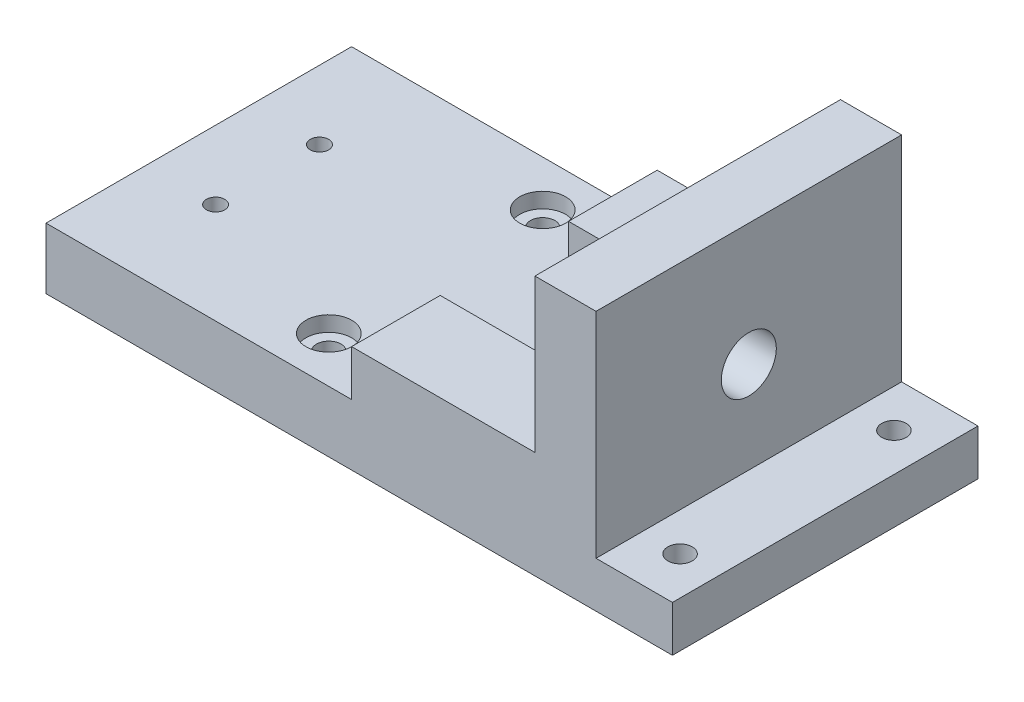
ISO-10303-21;
HEADER;
FILE_DESCRIPTION(('STEP AP214'),'2;1');
FILE_NAME('part.step','',(''),(''),'','','');
FILE_SCHEMA(('AUTOMOTIVE_DESIGN { 1 0 10303 214 1 1 1 1 }'));
ENDSEC;
DATA;
#1=APPLICATION_CONTEXT('core data for automotive mechanical design processes');
#2=APPLICATION_PROTOCOL_DEFINITION('international standard','automotive_design',2000,#1);
#3=PRODUCT_CONTEXT('',#1,'mechanical');
#4=PRODUCT('Part','Part','',(#3));
#5=PRODUCT_RELATED_PRODUCT_CATEGORY('part','',(#4));
#6=PRODUCT_DEFINITION_FORMATION('','',#4);
#7=PRODUCT_DEFINITION_CONTEXT('part definition',#1,'design');
#8=PRODUCT_DEFINITION('design','',#6,#7);
#9=PRODUCT_DEFINITION_SHAPE('','',#8);
#10=(LENGTH_UNIT() NAMED_UNIT(*) SI_UNIT(.MILLI.,.METRE.));
#11=(NAMED_UNIT(*) PLANE_ANGLE_UNIT() SI_UNIT($,.RADIAN.));
#12=(NAMED_UNIT(*) SI_UNIT($,.STERADIAN.) SOLID_ANGLE_UNIT());
#13=UNCERTAINTY_MEASURE_WITH_UNIT(LENGTH_MEASURE(1.E-05),#10,'distance_accuracy_value','');
#14=(GEOMETRIC_REPRESENTATION_CONTEXT(3) GLOBAL_UNCERTAINTY_ASSIGNED_CONTEXT((#13)) GLOBAL_UNIT_ASSIGNED_CONTEXT((#10,
#11,#12)) REPRESENTATION_CONTEXT('',''));
#15=CARTESIAN_POINT('',(0.,0.,0.));
#16=DIRECTION('',(0.,0.,1.));
#17=DIRECTION('',(1.,0.,0.));
#18=AXIS2_PLACEMENT_3D('',#15,#16,#17);
#19=CARTESIAN_POINT('',(-229.725095615959,-32.3557386046512,85.));
#20=DIRECTION('',(0.,1.,0.));
#21=DIRECTION('',(-1.,0.,0.));
#22=AXIS2_PLACEMENT_3D('',#19,#20,#21);
#23=CYLINDRICAL_SURFACE('',#22,3.99999999999999);
#24=CARTESIAN_POINT('',(-229.725095615959,-26.3557386046512,85.));
#25=DIRECTION('',(0.,1.,0.));
#26=DIRECTION('',(-1.,0.,0.));
#27=AXIS2_PLACEMENT_3D('',#24,#25,#26);
#28=CIRCLE('',#27,3.99999999999999);
#29=CARTESIAN_POINT('',(-233.725095615959,-26.3557386046512,85.));
#30=VERTEX_POINT('',#29);
#31=EDGE_CURVE('E231',#30,#30,#28,.F.);
#32=ORIENTED_EDGE('',*,*,#31,.T.);
#33=EDGE_LOOP('',(#32));
#34=FACE_BOUND('',#33,.T.);
#35=CARTESIAN_POINT('',(-229.725095615959,-11.3557386046512,85.));
#36=DIRECTION('',(0.,1.,0.));
#37=DIRECTION('',(-1.,0.,0.));
#38=AXIS2_PLACEMENT_3D('',#35,#36,#37);
#39=CIRCLE('',#38,3.99999999999999);
#40=CARTESIAN_POINT('',(-233.725095615959,-11.3557386046512,85.));
#41=VERTEX_POINT('',#40);
#42=EDGE_CURVE('E39',#41,#41,#39,.T.);
#43=ORIENTED_EDGE('',*,*,#42,.T.);
#44=EDGE_LOOP('',(#43));
#45=FACE_BOUND('',#44,.T.);
#46=ADVANCED_FACE('F35',(#34,#45),#23,.F.);
#47=CARTESIAN_POINT('',(-229.725095615959,-32.3557386046512,15.));
#48=DIRECTION('',(0.,1.,0.));
#49=DIRECTION('',(-1.,0.,0.));
#50=AXIS2_PLACEMENT_3D('',#47,#48,#49);
#51=CYLINDRICAL_SURFACE('',#50,3.99999999999999);
#52=CARTESIAN_POINT('',(-229.725095615959,-26.3557386046512,15.));
#53=DIRECTION('',(0.,1.,0.));
#54=DIRECTION('',(-1.,0.,0.));
#55=AXIS2_PLACEMENT_3D('',#52,#53,#54);
#56=CIRCLE('',#55,3.99999999999999);
#57=CARTESIAN_POINT('',(-233.725095615959,-26.3557386046512,15.));
#58=VERTEX_POINT('',#57);
#59=EDGE_CURVE('E219',#58,#58,#56,.T.);
#60=ORIENTED_EDGE('',*,*,#59,.F.);
#61=EDGE_LOOP('',(#60));
#62=FACE_BOUND('',#61,.T.);
#63=CARTESIAN_POINT('',(-229.725095615959,-11.3557386046512,15.));
#64=DIRECTION('',(0.,1.,0.));
#65=DIRECTION('',(-1.,0.,0.));
#66=AXIS2_PLACEMENT_3D('',#63,#64,#65);
#67=CIRCLE('',#66,3.99999999999999);
#68=CARTESIAN_POINT('',(-233.725095615959,-11.3557386046512,15.));
#69=VERTEX_POINT('',#68);
#70=EDGE_CURVE('E217',#69,#69,#67,.F.);
#71=ORIENTED_EDGE('',*,*,#70,.F.);
#72=EDGE_LOOP('',(#71));
#73=FACE_BOUND('',#72,.T.);
#74=ADVANCED_FACE('F348',(#62,#73),#51,.F.);
#75=CARTESIAN_POINT('',(-207.269612093023,8.64426139534883,100.));
#76=DIRECTION('',(0.,-1.,0.));
#77=DIRECTION('',(1.,0.,0.));
#78=AXIS2_PLACEMENT_3D('',#75,#76,#77);
#79=PLANE('',#78);
#80=DIRECTION('',(0.,0.,-1.));
#81=VECTOR('',#80,1.);
#82=CARTESIAN_POINT('',(-207.269612093023,8.64426139534883,100.));
#83=LINE('',#82,#81);
#84=CARTESIAN_POINT('',(-207.269612093023,8.64426139534883,29.));
#85=VERTEX_POINT('',#84);
#86=CARTESIAN_POINT('',(-207.269612093023,8.64426139534883,0.));
#87=VERTEX_POINT('',#86);
#88=EDGE_CURVE('E149',#85,#87,#83,.T.);
#89=ORIENTED_EDGE('',*,*,#88,.F.);
#90=DIRECTION('',(-1.,0.,0.));
#91=VECTOR('',#90,1.);
#92=CARTESIAN_POINT('',(-207.269612093023,8.64426139534883,29.));
#93=LINE('',#92,#91);
#94=CARTESIAN_POINT('',(-147.269612093023,8.64426139534884,29.));
#95=VERTEX_POINT('',#94);
#96=EDGE_CURVE('E255',#95,#85,#93,.T.);
#97=ORIENTED_EDGE('',*,*,#96,.F.);
#98=DIRECTION('',(0.,0.,-1.));
#99=VECTOR('',#98,1.);
#100=CARTESIAN_POINT('',(-147.269612093023,8.64426139534884,100.));
#101=LINE('',#100,#99);
#102=CARTESIAN_POINT('',(-147.269612093023,8.64426139534884,0.));
#103=VERTEX_POINT('',#102);
#104=EDGE_CURVE('E148',#95,#103,#101,.T.);
#105=ORIENTED_EDGE('',*,*,#104,.T.);
#106=DIRECTION('',(-1.,0.,0.));
#107=VECTOR('',#106,1.);
#108=CARTESIAN_POINT('',(-207.269612093023,8.64426139534883,0.));
#109=LINE('',#108,#107);
#110=EDGE_CURVE('E176',#103,#87,#109,.T.);
#111=ORIENTED_EDGE('',*,*,#110,.T.);
#112=EDGE_LOOP('',(#89,#97,#105,#111));
#113=FACE_BOUND('',#112,.T.);
#114=ADVANCED_FACE('F314',(#113),#79,.F.);
#115=CARTESIAN_POINT('',(-207.269612093023,-6.35573860465117,100.));
#116=DIRECTION('',(1.,0.,0.));
#117=DIRECTION('',(0.,0.,-1.));
#118=AXIS2_PLACEMENT_3D('',#115,#116,#117);
#119=PLANE('',#118);
#120=DIRECTION('',(0.,0.,-1.));
#121=VECTOR('',#120,1.);
#122=CARTESIAN_POINT('',(-207.269612093023,-6.35573860465117,100.));
#123=LINE('',#122,#121);
#124=CARTESIAN_POINT('',(-207.269612093023,-6.35573860465117,29.));
#125=VERTEX_POINT('',#124);
#126=CARTESIAN_POINT('',(-207.269612093023,-6.35573860465117,0.));
#127=VERTEX_POINT('',#126);
#128=EDGE_CURVE('E185',#125,#127,#123,.T.);
#129=ORIENTED_EDGE('',*,*,#128,.F.);
#130=DIRECTION('',(0.,1.,0.));
#131=VECTOR('',#130,1.);
#132=CARTESIAN_POINT('',(-207.269612093023,-6.35573860465117,29.));
#133=LINE('',#132,#131);
#134=EDGE_CURVE('E163',#125,#85,#133,.T.);
#135=ORIENTED_EDGE('',*,*,#134,.T.);
#136=ORIENTED_EDGE('',*,*,#88,.T.);
#137=DIRECTION('',(0.,-1.,0.));
#138=VECTOR('',#137,1.);
#139=CARTESIAN_POINT('',(-207.269612093023,-6.35573860465117,0.));
#140=LINE('',#139,#138);
#141=EDGE_CURVE('E179',#87,#127,#140,.T.);
#142=ORIENTED_EDGE('',*,*,#141,.T.);
#143=EDGE_LOOP('',(#129,#135,#136,#142));
#144=FACE_BOUND('',#143,.T.);
#145=ADVANCED_FACE('F313',(#144),#119,.F.);
#146=CARTESIAN_POINT('',(-307.269612093023,-6.3557386046512,100.));
#147=DIRECTION('',(1.,0.,0.));
#148=DIRECTION('',(0.,0.,-1.));
#149=AXIS2_PLACEMENT_3D('',#146,#147,#148);
#150=PLANE('',#149);
#151=DIRECTION('',(0.,-1.,0.));
#152=VECTOR('',#151,1.);
#153=CARTESIAN_POINT('',(-307.269612093023,-6.3557386046512,0.));
#154=LINE('',#153,#152);
#155=CARTESIAN_POINT('',(-307.269612093023,-6.3557386046512,0.));
#156=VERTEX_POINT('',#155);
#157=CARTESIAN_POINT('',(-307.269612093023,-26.3557386046512,0.));
#158=VERTEX_POINT('',#157);
#159=EDGE_CURVE('E159',#156,#158,#154,.T.);
#160=ORIENTED_EDGE('',*,*,#159,.T.);
#161=DIRECTION('',(0.,0.,-1.));
#162=VECTOR('',#161,1.);
#163=CARTESIAN_POINT('',(-307.269612093023,-26.3557386046512,100.));
#164=LINE('',#163,#162);
#165=CARTESIAN_POINT('',(-307.269612093023,-26.3557386046512,100.));
#166=VERTEX_POINT('',#165);
#167=EDGE_CURVE('E11',#166,#158,#164,.T.);
#168=ORIENTED_EDGE('',*,*,#167,.F.);
#169=DIRECTION('',(0.,-1.,0.));
#170=VECTOR('',#169,1.);
#171=CARTESIAN_POINT('',(-307.269612093023,-6.3557386046512,100.));
#172=LINE('',#171,#170);
#173=CARTESIAN_POINT('',(-307.269612093023,-6.3557386046512,100.));
#174=VERTEX_POINT('',#173);
#175=EDGE_CURVE('E183',#174,#166,#172,.T.);
#176=ORIENTED_EDGE('',*,*,#175,.F.);
#177=DIRECTION('',(0.,0.,-1.));
#178=VECTOR('',#177,1.);
#179=CARTESIAN_POINT('',(-307.269612093023,-6.3557386046512,100.));
#180=LINE('',#179,#178);
#181=EDGE_CURVE('E155',#174,#156,#180,.T.);
#182=ORIENTED_EDGE('',*,*,#181,.T.);
#183=EDGE_LOOP('',(#160,#168,#176,#182));
#184=FACE_BOUND('',#183,.T.);
#185=ADVANCED_FACE('F37',(#184),#150,.F.);
#186=CARTESIAN_POINT('',(-307.269612093023,-26.3557386046512,100.));
#187=DIRECTION('',(0.,1.,0.));
#188=DIRECTION('',(-1.,0.,0.));
#189=AXIS2_PLACEMENT_3D('',#186,#187,#188);
#190=PLANE('',#189);
#191=ORIENTED_EDGE('',*,*,#31,.F.);
#192=EDGE_LOOP('',(#191));
#193=FACE_BOUND('',#192,.T.);
#194=ORIENTED_EDGE('',*,*,#59,.T.);
#195=EDGE_LOOP('',(#194));
#196=FACE_BOUND('',#195,.T.);
#197=CARTESIAN_POINT('',(-284.769612093023,-26.3557386046512,67.));
#198=DIRECTION('',(0.,1.,0.));
#199=DIRECTION('',(-1.,0.,0.));
#200=AXIS2_PLACEMENT_3D('',#197,#198,#199);
#201=CIRCLE('',#200,2.99999999999999);
#202=CARTESIAN_POINT('',(-287.769612093023,-26.3557386046512,67.));
#203=VERTEX_POINT('',#202);
#204=EDGE_CURVE('E212',#203,#203,#201,.F.);
#205=ORIENTED_EDGE('',*,*,#204,.F.);
#206=EDGE_LOOP('',(#205));
#207=FACE_BOUND('',#206,.T.);
#208=CARTESIAN_POINT('',(-114.769612093023,-26.3557386046512,85.));
#209=DIRECTION('',(0.,1.,0.));
#210=DIRECTION('',(-1.,0.,0.));
#211=AXIS2_PLACEMENT_3D('',#208,#209,#210);
#212=CIRCLE('',#211,4.00000000000001);
#213=CARTESIAN_POINT('',(-118.769612093023,-26.3557386046512,85.));
#214=VERTEX_POINT('',#213);
#215=EDGE_CURVE('E211',#214,#214,#212,.F.);
#216=ORIENTED_EDGE('',*,*,#215,.F.);
#217=EDGE_LOOP('',(#216));
#218=FACE_BOUND('',#217,.T.);
#219=CARTESIAN_POINT('',(-284.769612093023,-26.3557386046512,33.));
#220=DIRECTION('',(0.,1.,0.));
#221=DIRECTION('',(-1.,0.,0.));
#222=AXIS2_PLACEMENT_3D('',#219,#220,#221);
#223=CIRCLE('',#222,2.99999999999999);
#224=CARTESIAN_POINT('',(-287.769612093023,-26.3557386046512,33.));
#225=VERTEX_POINT('',#224);
#226=EDGE_CURVE('E207',#225,#225,#223,.T.);
#227=ORIENTED_EDGE('',*,*,#226,.T.);
#228=EDGE_LOOP('',(#227));
#229=FACE_BOUND('',#228,.T.);
#230=CARTESIAN_POINT('',(-114.769612093023,-26.3557386046512,15.));
#231=DIRECTION('',(0.,1.,0.));
#232=DIRECTION('',(-1.,0.,0.));
#233=AXIS2_PLACEMENT_3D('',#230,#231,#232);
#234=CIRCLE('',#233,4.00000000000001);
#235=CARTESIAN_POINT('',(-118.769612093023,-26.3557386046512,15.));
#236=VERTEX_POINT('',#235);
#237=EDGE_CURVE('E206',#236,#236,#234,.T.);
#238=ORIENTED_EDGE('',*,*,#237,.T.);
#239=EDGE_LOOP('',(#238));
#240=FACE_BOUND('',#239,.T.);
#241=DIRECTION('',(1.,0.,0.));
#242=VECTOR('',#241,1.);
#243=CARTESIAN_POINT('',(-307.269612093023,-26.3557386046512,0.));
#244=LINE('',#243,#242);
#245=CARTESIAN_POINT('',(-102.269612093023,-26.3557386046512,0.));
#246=VERTEX_POINT('',#245);
#247=EDGE_CURVE('E162',#158,#246,#244,.T.);
#248=ORIENTED_EDGE('',*,*,#247,.T.);
#249=DIRECTION('',(0.,0.,-1.));
#250=VECTOR('',#249,1.);
#251=CARTESIAN_POINT('',(-102.269612093023,-26.3557386046512,100.));
#252=LINE('',#251,#250);
#253=CARTESIAN_POINT('',(-102.269612093023,-26.3557386046512,100.));
#254=VERTEX_POINT('',#253);
#255=EDGE_CURVE('E44',#254,#246,#252,.T.);
#256=ORIENTED_EDGE('',*,*,#255,.F.);
#257=DIRECTION('',(1.,0.,0.));
#258=VECTOR('',#257,1.);
#259=CARTESIAN_POINT('',(-307.269612093023,-26.3557386046512,100.));
#260=LINE('',#259,#258);
#261=EDGE_CURVE('E105',#166,#254,#260,.T.);
#262=ORIENTED_EDGE('',*,*,#261,.F.);
#263=ORIENTED_EDGE('',*,*,#167,.T.);
#264=EDGE_LOOP('',(#248,#256,#262,#263));
#265=FACE_BOUND('',#264,.T.);
#266=ADVANCED_FACE('F337',(#193,#196,#207,#218,#229,#240,#265),#190,.F.);
#267=CARTESIAN_POINT('',(-102.269612093023,-26.3557386046512,100.));
#268=DIRECTION('',(-1.,0.,0.));
#269=DIRECTION('',(0.,-1.,0.));
#270=AXIS2_PLACEMENT_3D('',#267,#268,#269);
#271=PLANE('',#270);
#272=DIRECTION('',(0.,1.,0.));
#273=VECTOR('',#272,1.);
#274=CARTESIAN_POINT('',(-102.269612093023,-26.3557386046512,0.));
#275=LINE('',#274,#273);
#276=CARTESIAN_POINT('',(-102.269612093023,-11.3557386046512,0.));
#277=VERTEX_POINT('',#276);
#278=EDGE_CURVE('E165',#246,#277,#275,.T.);
#279=ORIENTED_EDGE('',*,*,#278,.T.);
#280=DIRECTION('',(0.,0.,-1.));
#281=VECTOR('',#280,1.);
#282=CARTESIAN_POINT('',(-102.269612093023,-11.3557386046512,100.));
#283=LINE('',#282,#281);
#284=CARTESIAN_POINT('',(-102.269612093023,-11.3557386046512,100.));
#285=VERTEX_POINT('',#284);
#286=EDGE_CURVE('E198',#285,#277,#283,.T.);
#287=ORIENTED_EDGE('',*,*,#286,.F.);
#288=DIRECTION('',(0.,1.,0.));
#289=VECTOR('',#288,1.);
#290=CARTESIAN_POINT('',(-102.269612093023,-26.3557386046512,100.));
#291=LINE('',#290,#289);
#292=EDGE_CURVE('E274',#254,#285,#291,.T.);
#293=ORIENTED_EDGE('',*,*,#292,.F.);
#294=ORIENTED_EDGE('',*,*,#255,.T.);
#295=EDGE_LOOP('',(#279,#287,#293,#294));
#296=FACE_BOUND('',#295,.T.);
#297=ADVANCED_FACE('F336',(#296),#271,.F.);
#298=CARTESIAN_POINT('',(-127.269612093023,-11.3557386046512,100.));
#299=DIRECTION('',(0.,-1.,0.));
#300=DIRECTION('',(0.,0.,-1.));
#301=AXIS2_PLACEMENT_3D('',#298,#299,#300);
#302=PLANE('',#301);
#303=CARTESIAN_POINT('',(-114.769612093023,-11.3557386046512,85.));
#304=DIRECTION('',(0.,-1.,0.));
#305=DIRECTION('',(0.,0.,-1.));
#306=AXIS2_PLACEMENT_3D('',#303,#304,#305);
#307=CIRCLE('',#306,4.00000000000001);
#308=CARTESIAN_POINT('',(-114.769612093023,-11.3557386046512,81.));
#309=VERTEX_POINT('',#308);
#310=EDGE_CURVE('E208',#309,#309,#307,.F.);
#311=ORIENTED_EDGE('',*,*,#310,.F.);
#312=EDGE_LOOP('',(#311));
#313=FACE_BOUND('',#312,.T.);
#314=CARTESIAN_POINT('',(-114.769612093023,-11.3557386046512,15.));
#315=DIRECTION('',(0.,-1.,0.));
#316=DIRECTION('',(0.,0.,-1.));
#317=AXIS2_PLACEMENT_3D('',#314,#315,#316);
#318=CIRCLE('',#317,4.00000000000001);
#319=CARTESIAN_POINT('',(-114.769612093023,-11.3557386046512,11.));
#320=VERTEX_POINT('',#319);
#321=EDGE_CURVE('E203',#320,#320,#318,.T.);
#322=ORIENTED_EDGE('',*,*,#321,.T.);
#323=EDGE_LOOP('',(#322));
#324=FACE_BOUND('',#323,.T.);
#325=DIRECTION('',(-1.,0.,0.));
#326=VECTOR('',#325,1.);
#327=CARTESIAN_POINT('',(-127.269612093023,-11.3557386046512,0.));
#328=LINE('',#327,#326);
#329=CARTESIAN_POINT('',(-127.269612093023,-11.3557386046512,0.));
#330=VERTEX_POINT('',#329);
#331=EDGE_CURVE('E167',#277,#330,#328,.T.);
#332=ORIENTED_EDGE('',*,*,#331,.T.);
#333=DIRECTION('',(0.,0.,-1.));
#334=VECTOR('',#333,1.);
#335=CARTESIAN_POINT('',(-127.269612093023,-11.3557386046512,100.));
#336=LINE('',#335,#334);
#337=CARTESIAN_POINT('',(-127.269612093023,-11.3557386046512,100.));
#338=VERTEX_POINT('',#337);
#339=EDGE_CURVE('E195',#338,#330,#336,.T.);
#340=ORIENTED_EDGE('',*,*,#339,.F.);
#341=DIRECTION('',(-1.,0.,0.));
#342=VECTOR('',#341,1.);
#343=CARTESIAN_POINT('',(-127.269612093023,-11.3557386046512,100.));
#344=LINE('',#343,#342);
#345=EDGE_CURVE('E276',#285,#338,#344,.T.);
#346=ORIENTED_EDGE('',*,*,#345,.F.);
#347=ORIENTED_EDGE('',*,*,#286,.T.);
#348=EDGE_LOOP('',(#332,#340,#346,#347));
#349=FACE_BOUND('',#348,.T.);
#350=ADVANCED_FACE('F332',(#313,#324,#349),#302,.F.);
#351=CARTESIAN_POINT('',(-127.269612093023,58.6442613953488,100.));
#352=DIRECTION('',(-1.,0.,0.));
#353=DIRECTION('',(0.,-1.,0.));
#354=AXIS2_PLACEMENT_3D('',#351,#352,#353);
#355=PLANE('',#354);
#356=CARTESIAN_POINT('',(-127.269612093023,18.6442613953488,50.));
#357=DIRECTION('',(1.,0.,0.));
#358=DIRECTION('',(0.,1.,0.));
#359=AXIS2_PLACEMENT_3D('',#356,#357,#358);
#360=CIRCLE('',#359,9.);
#361=CARTESIAN_POINT('',(-127.269612093023,27.6442613953489,50.));
#362=VERTEX_POINT('',#361);
#363=EDGE_CURVE('E216',#362,#362,#360,.T.);
#364=ORIENTED_EDGE('',*,*,#363,.F.);
#365=EDGE_LOOP('',(#364));
#366=FACE_BOUND('',#365,.T.);
#367=DIRECTION('',(0.,1.,0.));
#368=VECTOR('',#367,1.);
#369=CARTESIAN_POINT('',(-127.269612093023,58.6442613953488,0.));
#370=LINE('',#369,#368);
#371=CARTESIAN_POINT('',(-127.269612093023,58.6442613953488,0.));
#372=VERTEX_POINT('',#371);
#373=EDGE_CURVE('E169',#330,#372,#370,.T.);
#374=ORIENTED_EDGE('',*,*,#373,.T.);
#375=DIRECTION('',(0.,0.,-1.));
#376=VECTOR('',#375,1.);
#377=CARTESIAN_POINT('',(-127.269612093023,58.6442613953488,100.));
#378=LINE('',#377,#376);
#379=CARTESIAN_POINT('',(-127.269612093023,58.6442613953488,100.));
#380=VERTEX_POINT('',#379);
#381=EDGE_CURVE('E192',#380,#372,#378,.T.);
#382=ORIENTED_EDGE('',*,*,#381,.F.);
#383=DIRECTION('',(0.,1.,0.));
#384=VECTOR('',#383,1.);
#385=CARTESIAN_POINT('',(-127.269612093023,58.6442613953488,100.));
#386=LINE('',#385,#384);
#387=EDGE_CURVE('E278',#338,#380,#386,.T.);
#388=ORIENTED_EDGE('',*,*,#387,.F.);
#389=ORIENTED_EDGE('',*,*,#339,.T.);
#390=EDGE_LOOP('',(#374,#382,#388,#389));
#391=FACE_BOUND('',#390,.T.);
#392=ADVANCED_FACE('F328',(#366,#391),#355,.F.);
#393=CARTESIAN_POINT('',(-147.269612093023,58.6442613953488,100.));
#394=DIRECTION('',(0.,-1.,0.));
#395=DIRECTION('',(1.,0.,0.));
#396=AXIS2_PLACEMENT_3D('',#393,#394,#395);
#397=PLANE('',#396);
#398=DIRECTION('',(-1.,0.,0.));
#399=VECTOR('',#398,1.);
#400=CARTESIAN_POINT('',(-147.269612093023,58.6442613953488,0.));
#401=LINE('',#400,#399);
#402=CARTESIAN_POINT('',(-147.269612093023,58.6442613953488,0.));
#403=VERTEX_POINT('',#402);
#404=EDGE_CURVE('E171',#372,#403,#401,.T.);
#405=ORIENTED_EDGE('',*,*,#404,.T.);
#406=DIRECTION('',(0.,0.,-1.));
#407=VECTOR('',#406,1.);
#408=CARTESIAN_POINT('',(-147.269612093023,58.6442613953488,100.));
#409=LINE('',#408,#407);
#410=CARTESIAN_POINT('',(-147.269612093023,58.6442613953488,100.));
#411=VERTEX_POINT('',#410);
#412=EDGE_CURVE('E189',#411,#403,#409,.T.);
#413=ORIENTED_EDGE('',*,*,#412,.F.);
#414=DIRECTION('',(-1.,0.,0.));
#415=VECTOR('',#414,1.);
#416=CARTESIAN_POINT('',(-147.269612093023,58.6442613953488,100.));
#417=LINE('',#416,#415);
#418=EDGE_CURVE('E280',#380,#411,#417,.T.);
#419=ORIENTED_EDGE('',*,*,#418,.F.);
#420=ORIENTED_EDGE('',*,*,#381,.T.);
#421=EDGE_LOOP('',(#405,#413,#419,#420));
#422=FACE_BOUND('',#421,.T.);
#423=ADVANCED_FACE('F286',(#422),#397,.F.);
#424=CARTESIAN_POINT('',(-147.269612093023,58.6442613953488,100.));
#425=DIRECTION('',(1.,0.,0.));
#426=DIRECTION('',(0.,1.,0.));
#427=AXIS2_PLACEMENT_3D('',#424,#425,#426);
#428=PLANE('',#427);
#429=CARTESIAN_POINT('',(-147.269612093023,18.6442613953489,50.));
#430=DIRECTION('',(1.,0.,0.));
#431=DIRECTION('',(0.,1.,0.));
#432=AXIS2_PLACEMENT_3D('',#429,#430,#431);
#433=CIRCLE('',#432,9.);
#434=CARTESIAN_POINT('',(-147.269612093023,27.6442613953489,50.));
#435=VERTEX_POINT('',#434);
#436=EDGE_CURVE('E213',#435,#435,#433,.T.);
#437=ORIENTED_EDGE('',*,*,#436,.T.);
#438=EDGE_LOOP('',(#437));
#439=FACE_BOUND('',#438,.T.);
#440=DIRECTION('',(0.,-1.,0.));
#441=VECTOR('',#440,1.);
#442=CARTESIAN_POINT('',(-147.269612093023,58.6442613953488,0.));
#443=LINE('',#442,#441);
#444=EDGE_CURVE('E173',#403,#103,#443,.T.);
#445=ORIENTED_EDGE('',*,*,#444,.T.);
#446=ORIENTED_EDGE('',*,*,#104,.F.);
#447=DIRECTION('',(0.,1.,0.));
#448=VECTOR('',#447,1.);
#449=CARTESIAN_POINT('',(-147.269612093023,-6.35573860465116,29.));
#450=LINE('',#449,#448);
#451=CARTESIAN_POINT('',(-147.269612093023,-6.35573860465116,29.));
#452=VERTEX_POINT('',#451);
#453=EDGE_CURVE('E264',#452,#95,#450,.T.);
#454=ORIENTED_EDGE('',*,*,#453,.F.);
#455=DIRECTION('',(0.,0.,-1.));
#456=VECTOR('',#455,1.);
#457=CARTESIAN_POINT('',(-147.269612093023,-6.35573860465116,71.));
#458=LINE('',#457,#456);
#459=CARTESIAN_POINT('',(-147.269612093023,-6.35573860465116,71.));
#460=VERTEX_POINT('',#459);
#461=EDGE_CURVE('E254',#460,#452,#458,.T.);
#462=ORIENTED_EDGE('',*,*,#461,.F.);
#463=DIRECTION('',(0.,1.,0.));
#464=VECTOR('',#463,1.);
#465=CARTESIAN_POINT('',(-147.269612093023,-6.35573860465116,71.));
#466=LINE('',#465,#464);
#467=CARTESIAN_POINT('',(-147.269612093023,8.64426139534884,71.));
#468=VERTEX_POINT('',#467);
#469=EDGE_CURVE('E267',#460,#468,#466,.T.);
#470=ORIENTED_EDGE('',*,*,#469,.T.);
#471=CARTESIAN_POINT('',(-147.269612093023,8.64426139534884,100.));
#472=VERTEX_POINT('',#471);
#473=EDGE_CURVE('E187',#472,#468,#101,.T.);
#474=ORIENTED_EDGE('',*,*,#473,.F.);
#475=DIRECTION('',(0.,-1.,0.));
#476=VECTOR('',#475,1.);
#477=CARTESIAN_POINT('',(-147.269612093023,58.6442613953488,100.));
#478=LINE('',#477,#476);
#479=EDGE_CURVE('E134',#411,#472,#478,.T.);
#480=ORIENTED_EDGE('',*,*,#479,.F.);
#481=ORIENTED_EDGE('',*,*,#412,.T.);
#482=EDGE_LOOP('',(#445,#446,#454,#462,#470,#474,#480,#481));
#483=FACE_BOUND('',#482,.T.);
#484=ADVANCED_FACE('F290',(#439,#483),#428,.F.);
#485=ORIENTED_EDGE('',*,*,#473,.T.);
#486=DIRECTION('',(1.,0.,0.));
#487=VECTOR('',#486,1.);
#488=CARTESIAN_POINT('',(-207.269612093023,8.64426139534883,71.));
#489=LINE('',#488,#487);
#490=CARTESIAN_POINT('',(-207.269612093023,8.64426139534883,71.));
#491=VERTEX_POINT('',#490);
#492=EDGE_CURVE('E145',#491,#468,#489,.T.);
#493=ORIENTED_EDGE('',*,*,#492,.F.);
#494=CARTESIAN_POINT('',(-207.269612093023,8.64426139534883,100.));
#495=VERTEX_POINT('',#494);
#496=EDGE_CURVE('E141',#495,#491,#83,.T.);
#497=ORIENTED_EDGE('',*,*,#496,.F.);
#498=DIRECTION('',(-1.,0.,0.));
#499=VECTOR('',#498,1.);
#500=CARTESIAN_POINT('',(-207.269612093023,8.64426139534883,100.));
#501=LINE('',#500,#499);
#502=EDGE_CURVE('E127',#472,#495,#501,.T.);
#503=ORIENTED_EDGE('',*,*,#502,.F.);
#504=EDGE_LOOP('',(#485,#493,#497,#503));
#505=FACE_BOUND('',#504,.T.);
#506=ADVANCED_FACE('F142',(#505),#79,.F.);
#507=ORIENTED_EDGE('',*,*,#496,.T.);
#508=DIRECTION('',(0.,1.,0.));
#509=VECTOR('',#508,1.);
#510=CARTESIAN_POINT('',(-207.269612093023,-6.35573860465117,71.));
#511=LINE('',#510,#509);
#512=CARTESIAN_POINT('',(-207.269612093023,-6.35573860465117,71.));
#513=VERTEX_POINT('',#512);
#514=EDGE_CURVE('E258',#513,#491,#511,.T.);
#515=ORIENTED_EDGE('',*,*,#514,.F.);
#516=CARTESIAN_POINT('',(-207.269612093023,-6.35573860465117,100.));
#517=VERTEX_POINT('',#516);
#518=EDGE_CURVE('E153',#517,#513,#123,.T.);
#519=ORIENTED_EDGE('',*,*,#518,.F.);
#520=DIRECTION('',(0.,-1.,0.));
#521=VECTOR('',#520,1.);
#522=CARTESIAN_POINT('',(-207.269612093023,-6.35573860465117,100.));
#523=LINE('',#522,#521);
#524=EDGE_CURVE('E131',#495,#517,#523,.T.);
#525=ORIENTED_EDGE('',*,*,#524,.F.);
#526=EDGE_LOOP('',(#507,#515,#519,#525));
#527=FACE_BOUND('',#526,.T.);
#528=ADVANCED_FACE('F151',(#527),#119,.F.);
#529=CARTESIAN_POINT('',(-307.269612093023,-6.3557386046512,100.));
#530=DIRECTION('',(0.,-1.,0.));
#531=DIRECTION('',(1.,0.,0.));
#532=AXIS2_PLACEMENT_3D('',#529,#530,#531);
#533=PLANE('',#532);
#534=CARTESIAN_POINT('',(-229.725095615959,-6.35573860465118,85.));
#535=DIRECTION('',(0.,-1.,0.));
#536=DIRECTION('',(-1.,0.,0.));
#537=AXIS2_PLACEMENT_3D('',#534,#535,#536);
#538=CIRCLE('',#537,7.50000000000001);
#539=CARTESIAN_POINT('',(-237.225095615959,-6.35573860465118,85.));
#540=VERTEX_POINT('',#539);
#541=EDGE_CURVE('E624',#540,#540,#538,.T.);
#542=ORIENTED_EDGE('',*,*,#541,.T.);
#543=EDGE_LOOP('',(#542));
#544=FACE_BOUND('',#543,.T.);
#545=CARTESIAN_POINT('',(-229.725095615959,-6.35573860465118,15.));
#546=DIRECTION('',(0.,1.,0.));
#547=DIRECTION('',(-1.,0.,0.));
#548=AXIS2_PLACEMENT_3D('',#545,#546,#547);
#549=CIRCLE('',#548,7.50000000000001);
#550=CARTESIAN_POINT('',(-237.225095615959,-6.35573860465118,15.));
#551=VERTEX_POINT('',#550);
#552=EDGE_CURVE('E226',#551,#551,#549,.T.);
#553=ORIENTED_EDGE('',*,*,#552,.F.);
#554=EDGE_LOOP('',(#553));
#555=FACE_BOUND('',#554,.T.);
#556=CARTESIAN_POINT('',(-284.769612093023,-6.35573860465119,67.));
#557=DIRECTION('',(0.,-1.,0.));
#558=DIRECTION('',(-1.,0.,0.));
#559=AXIS2_PLACEMENT_3D('',#556,#557,#558);
#560=CIRCLE('',#559,2.99999999999999);
#561=CARTESIAN_POINT('',(-287.769612093023,-6.35573860465119,67.));
#562=VERTEX_POINT('',#561);
#563=EDGE_CURVE('E215',#562,#562,#560,.T.);
#564=ORIENTED_EDGE('',*,*,#563,.T.);
#565=EDGE_LOOP('',(#564));
#566=FACE_BOUND('',#565,.T.);
#567=CARTESIAN_POINT('',(-284.769612093023,-6.35573860465119,33.));
#568=DIRECTION('',(0.,1.,0.));
#569=DIRECTION('',(-1.,0.,0.));
#570=AXIS2_PLACEMENT_3D('',#567,#568,#569);
#571=CIRCLE('',#570,2.99999999999999);
#572=CARTESIAN_POINT('',(-287.769612093023,-6.35573860465119,33.));
#573=VERTEX_POINT('',#572);
#574=EDGE_CURVE('E244',#573,#573,#571,.T.);
#575=ORIENTED_EDGE('',*,*,#574,.F.);
#576=EDGE_LOOP('',(#575));
#577=FACE_BOUND('',#576,.T.);
#578=DIRECTION('',(-1.,0.,0.));
#579=VECTOR('',#578,1.);
#580=CARTESIAN_POINT('',(-307.269612093023,-6.3557386046512,0.));
#581=LINE('',#580,#579);
#582=EDGE_CURVE('E97',#127,#156,#581,.T.);
#583=ORIENTED_EDGE('',*,*,#582,.T.);
#584=ORIENTED_EDGE('',*,*,#181,.F.);
#585=DIRECTION('',(-1.,0.,0.));
#586=VECTOR('',#585,1.);
#587=CARTESIAN_POINT('',(-307.269612093023,-6.3557386046512,100.));
#588=LINE('',#587,#586);
#589=EDGE_CURVE('E61',#517,#174,#588,.T.);
#590=ORIENTED_EDGE('',*,*,#589,.F.);
#591=ORIENTED_EDGE('',*,*,#518,.T.);
#592=DIRECTION('',(1.,0.,0.));
#593=VECTOR('',#592,1.);
#594=CARTESIAN_POINT('',(-207.269612093023,-6.35573860465117,71.));
#595=LINE('',#594,#593);
#596=EDGE_CURVE('E251',#513,#460,#595,.T.);
#597=ORIENTED_EDGE('',*,*,#596,.T.);
#598=ORIENTED_EDGE('',*,*,#461,.T.);
#599=DIRECTION('',(-1.,0.,0.));
#600=VECTOR('',#599,1.);
#601=CARTESIAN_POINT('',(-207.269612093023,-6.35573860465117,29.));
#602=LINE('',#601,#600);
#603=EDGE_CURVE('E52',#452,#125,#602,.T.);
#604=ORIENTED_EDGE('',*,*,#603,.T.);
#605=ORIENTED_EDGE('',*,*,#128,.T.);
#606=EDGE_LOOP('',(#583,#584,#590,#591,#597,#598,#604,#605));
#607=FACE_BOUND('',#606,.T.);
#608=ADVANCED_FACE('F324',(#544,#555,#566,#577,#607),#533,.F.);
#609=CARTESIAN_POINT('',(0.,0.,100.));
#610=DIRECTION('',(0.,0.,1.));
#611=DIRECTION('',(1.,0.,0.));
#612=AXIS2_PLACEMENT_3D('',#609,#610,#611);
#613=PLANE('',#612);
#614=ORIENTED_EDGE('',*,*,#175,.T.);
#615=ORIENTED_EDGE('',*,*,#261,.T.);
#616=ORIENTED_EDGE('',*,*,#292,.T.);
#617=ORIENTED_EDGE('',*,*,#345,.T.);
#618=ORIENTED_EDGE('',*,*,#387,.T.);
#619=ORIENTED_EDGE('',*,*,#418,.T.);
#620=ORIENTED_EDGE('',*,*,#479,.T.);
#621=ORIENTED_EDGE('',*,*,#502,.T.);
#622=ORIENTED_EDGE('',*,*,#524,.T.);
#623=ORIENTED_EDGE('',*,*,#589,.T.);
#624=EDGE_LOOP('',(#614,#615,#616,#617,#618,#619,#620,#621,#622,#623));
#625=FACE_BOUND('',#624,.T.);
#626=ADVANCED_FACE('F129',(#625),#613,.T.);
#627=CARTESIAN_POINT('',(0.,0.,0.));
#628=DIRECTION('',(0.,0.,1.));
#629=DIRECTION('',(1.,0.,0.));
#630=AXIS2_PLACEMENT_3D('',#627,#628,#629);
#631=PLANE('',#630);
#632=ORIENTED_EDGE('',*,*,#159,.F.);
#633=ORIENTED_EDGE('',*,*,#582,.F.);
#634=ORIENTED_EDGE('',*,*,#141,.F.);
#635=ORIENTED_EDGE('',*,*,#110,.F.);
#636=ORIENTED_EDGE('',*,*,#444,.F.);
#637=ORIENTED_EDGE('',*,*,#404,.F.);
#638=ORIENTED_EDGE('',*,*,#373,.F.);
#639=ORIENTED_EDGE('',*,*,#331,.F.);
#640=ORIENTED_EDGE('',*,*,#278,.F.);
#641=ORIENTED_EDGE('',*,*,#247,.F.);
#642=EDGE_LOOP('',(#632,#633,#634,#635,#636,#637,#638,#639,#640,#641));
#643=FACE_BOUND('',#642,.T.);
#644=ADVANCED_FACE('F319',(#643),#631,.F.);
#645=CARTESIAN_POINT('',(-207.269612093023,-6.35573860465117,29.));
#646=DIRECTION('',(0.,0.,-1.));
#647=DIRECTION('',(-1.,0.,0.));
#648=AXIS2_PLACEMENT_3D('',#645,#646,#647);
#649=PLANE('',#648);
#650=ORIENTED_EDGE('',*,*,#96,.T.);
#651=ORIENTED_EDGE('',*,*,#134,.F.);
#652=ORIENTED_EDGE('',*,*,#603,.F.);
#653=ORIENTED_EDGE('',*,*,#453,.T.);
#654=EDGE_LOOP('',(#650,#651,#652,#653));
#655=FACE_BOUND('',#654,.T.);
#656=ADVANCED_FACE('F307',(#655),#649,.F.);
#657=CARTESIAN_POINT('',(-207.269612093023,-6.35573860465117,71.));
#658=DIRECTION('',(0.,0.,1.));
#659=DIRECTION('',(1.,0.,0.));
#660=AXIS2_PLACEMENT_3D('',#657,#658,#659);
#661=PLANE('',#660);
#662=ORIENTED_EDGE('',*,*,#492,.T.);
#663=ORIENTED_EDGE('',*,*,#469,.F.);
#664=ORIENTED_EDGE('',*,*,#596,.F.);
#665=ORIENTED_EDGE('',*,*,#514,.T.);
#666=EDGE_LOOP('',(#662,#663,#664,#665));
#667=FACE_BOUND('',#666,.T.);
#668=ADVANCED_FACE('F385',(#667),#661,.F.);
#669=CARTESIAN_POINT('',(-284.769612093023,-42.3557386046512,33.));
#670=DIRECTION('',(0.,1.,0.));
#671=DIRECTION('',(-1.,0.,0.));
#672=AXIS2_PLACEMENT_3D('',#669,#670,#671);
#673=CYLINDRICAL_SURFACE('',#672,2.99999999999999);
#674=ORIENTED_EDGE('',*,*,#574,.T.);
#675=EDGE_LOOP('',(#674));
#676=FACE_BOUND('',#675,.T.);
#677=ORIENTED_EDGE('',*,*,#226,.F.);
#678=EDGE_LOOP('',(#677));
#679=FACE_BOUND('',#678,.T.);
#680=ADVANCED_FACE('F382',(#676,#679),#673,.F.);
#681=CARTESIAN_POINT('',(-114.769612093023,-42.3557386046512,15.));
#682=DIRECTION('',(0.,1.,0.));
#683=DIRECTION('',(-1.,0.,0.));
#684=AXIS2_PLACEMENT_3D('',#681,#682,#683);
#685=CYLINDRICAL_SURFACE('',#684,4.00000000000001);
#686=ORIENTED_EDGE('',*,*,#321,.F.);
#687=EDGE_LOOP('',(#686));
#688=FACE_BOUND('',#687,.T.);
#689=ORIENTED_EDGE('',*,*,#237,.F.);
#690=EDGE_LOOP('',(#689));
#691=FACE_BOUND('',#690,.T.);
#692=ADVANCED_FACE('F377',(#688,#691),#685,.F.);
#693=CARTESIAN_POINT('',(-284.769612093023,-42.3557386046512,67.));
#694=DIRECTION('',(0.,1.,0.));
#695=DIRECTION('',(-1.,0.,0.));
#696=AXIS2_PLACEMENT_3D('',#693,#694,#695);
#697=CYLINDRICAL_SURFACE('',#696,2.99999999999999);
#698=ORIENTED_EDGE('',*,*,#563,.F.);
#699=EDGE_LOOP('',(#698));
#700=FACE_BOUND('',#699,.T.);
#701=ORIENTED_EDGE('',*,*,#204,.T.);
#702=EDGE_LOOP('',(#701));
#703=FACE_BOUND('',#702,.T.);
#704=ADVANCED_FACE('F374',(#700,#703),#697,.F.);
#705=CARTESIAN_POINT('',(-114.769612093023,-42.3557386046512,85.));
#706=DIRECTION('',(0.,1.,0.));
#707=DIRECTION('',(-1.,0.,0.));
#708=AXIS2_PLACEMENT_3D('',#705,#706,#707);
#709=CYLINDRICAL_SURFACE('',#708,4.00000000000001);
#710=ORIENTED_EDGE('',*,*,#310,.T.);
#711=EDGE_LOOP('',(#710));
#712=FACE_BOUND('',#711,.T.);
#713=ORIENTED_EDGE('',*,*,#215,.T.);
#714=EDGE_LOOP('',(#713));
#715=FACE_BOUND('',#714,.T.);
#716=ADVANCED_FACE('F372',(#712,#715),#709,.F.);
#717=CARTESIAN_POINT('',(-153.269612093023,18.6442613953489,50.));
#718=DIRECTION('',(1.,0.,0.));
#719=DIRECTION('',(0.,1.,0.));
#720=AXIS2_PLACEMENT_3D('',#717,#718,#719);
#721=CYLINDRICAL_SURFACE('',#720,9.);
#722=ORIENTED_EDGE('',*,*,#363,.T.);
#723=EDGE_LOOP('',(#722));
#724=FACE_BOUND('',#723,.T.);
#725=ORIENTED_EDGE('',*,*,#436,.F.);
#726=EDGE_LOOP('',(#725));
#727=FACE_BOUND('',#726,.T.);
#728=ADVANCED_FACE('F366',(#724,#727),#721,.F.);
#729=CARTESIAN_POINT('',(-229.725095615959,-11.3557386046512,15.));
#730=DIRECTION('',(0.,1.,0.));
#731=DIRECTION('',(-1.,0.,0.));
#732=AXIS2_PLACEMENT_3D('',#729,#730,#731);
#733=PLANE('',#732);
#734=CARTESIAN_POINT('',(-229.725095615959,-11.3557386046512,15.));
#735=DIRECTION('',(0.,1.,0.));
#736=DIRECTION('',(-1.,0.,0.));
#737=AXIS2_PLACEMENT_3D('',#734,#735,#736);
#738=CIRCLE('',#737,7.50000000000001);
#739=CARTESIAN_POINT('',(-237.225095615959,-11.3557386046512,15.));
#740=VERTEX_POINT('',#739);
#741=EDGE_CURVE('E220',#740,#740,#738,.T.);
#742=ORIENTED_EDGE('',*,*,#741,.T.);
#743=EDGE_LOOP('',(#742));
#744=FACE_BOUND('',#743,.T.);
#745=ORIENTED_EDGE('',*,*,#70,.T.);
#746=EDGE_LOOP('',(#745));
#747=FACE_BOUND('',#746,.T.);
#748=ADVANCED_FACE('F362',(#744,#747),#733,.T.);
#749=CARTESIAN_POINT('',(-229.725095615959,-11.3557386046512,15.));
#750=DIRECTION('',(0.,1.,0.));
#751=DIRECTION('',(-1.,0.,0.));
#752=AXIS2_PLACEMENT_3D('',#749,#750,#751);
#753=CYLINDRICAL_SURFACE('',#752,7.50000000000001);
#754=ORIENTED_EDGE('',*,*,#741,.F.);
#755=EDGE_LOOP('',(#754));
#756=FACE_BOUND('',#755,.T.);
#757=ORIENTED_EDGE('',*,*,#552,.T.);
#758=EDGE_LOOP('',(#757));
#759=FACE_BOUND('',#758,.T.);
#760=ADVANCED_FACE('F365',(#756,#759),#753,.F.);
#761=CARTESIAN_POINT('',(-229.725095615959,-11.3557386046512,85.));
#762=DIRECTION('',(0.,1.,0.));
#763=DIRECTION('',(-1.,0.,0.));
#764=AXIS2_PLACEMENT_3D('',#761,#762,#763);
#765=CYLINDRICAL_SURFACE('',#764,7.50000000000001);
#766=CARTESIAN_POINT('',(-229.725095615959,-11.3557386046512,85.));
#767=DIRECTION('',(0.,-1.,0.));
#768=DIRECTION('',(-1.,0.,0.));
#769=AXIS2_PLACEMENT_3D('',#766,#767,#768);
#770=CIRCLE('',#769,7.50000000000001);
#771=CARTESIAN_POINT('',(-237.225095615959,-11.3557386046512,85.));
#772=VERTEX_POINT('',#771);
#773=EDGE_CURVE('E623',#772,#772,#770,.T.);
#774=ORIENTED_EDGE('',*,*,#773,.T.);
#775=EDGE_LOOP('',(#774));
#776=FACE_BOUND('',#775,.T.);
#777=ORIENTED_EDGE('',*,*,#541,.F.);
#778=EDGE_LOOP('',(#777));
#779=FACE_BOUND('',#778,.T.);
#780=ADVANCED_FACE('F360',(#776,#779),#765,.F.);
#781=CARTESIAN_POINT('',(-229.725095615959,-11.3557386046512,85.));
#782=DIRECTION('',(0.,1.,0.));
#783=DIRECTION('',(-1.,0.,0.));
#784=AXIS2_PLACEMENT_3D('',#781,#782,#783);
#785=PLANE('',#784);
#786=ORIENTED_EDGE('',*,*,#42,.F.);
#787=EDGE_LOOP('',(#786));
#788=FACE_BOUND('',#787,.T.);
#789=ORIENTED_EDGE('',*,*,#773,.F.);
#790=EDGE_LOOP('',(#789));
#791=FACE_BOUND('',#790,.T.);
#792=ADVANCED_FACE('F510',(#788,#791),#785,.T.);
#793=CLOSED_SHELL('',(#46,#74,#114,#145,#185,#266,#297,#350,#392,#423,#484,#506,#528,#608,#626,
#644,#656,#668,#680,#692,#704,#716,#728,#748,#760,#780,#792));
#794=MANIFOLD_SOLID_BREP('B2',#793);
#795=ADVANCED_BREP_SHAPE_REPRESENTATION('',(#18,#794),#14);
#796=SHAPE_DEFINITION_REPRESENTATION(#9,#795);
ENDSEC;
END-ISO-10303-21;
